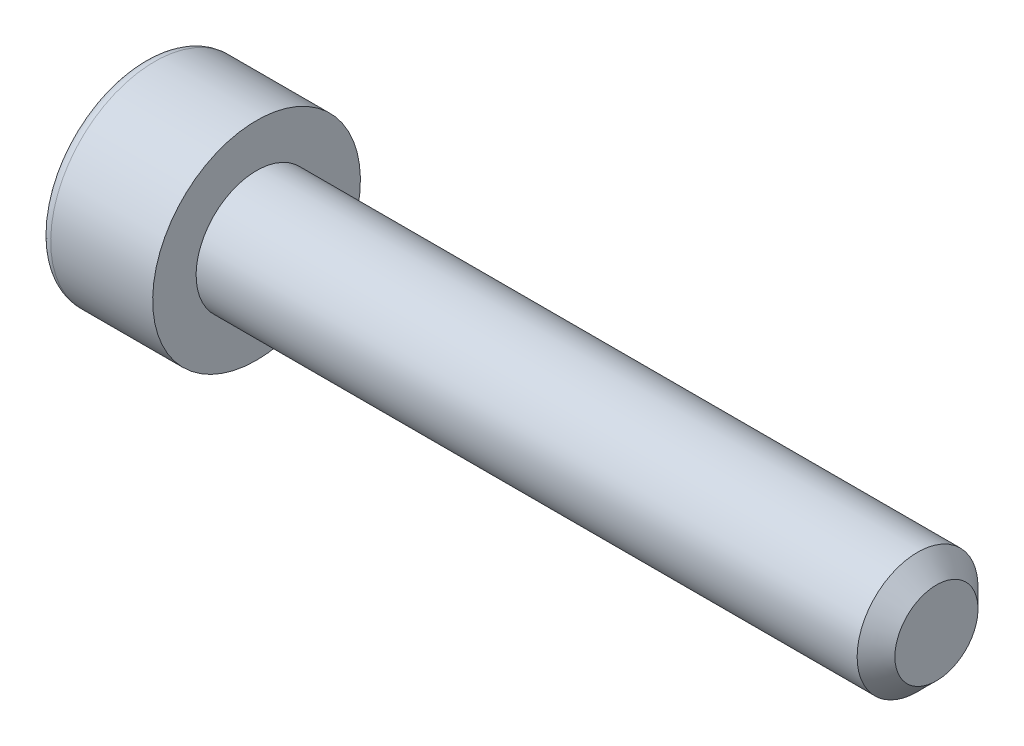
ISO-10303-21;
HEADER;
FILE_DESCRIPTION(('STEP AP214'),'2;1');
FILE_NAME('part.step','',(''),(''),'','','');
FILE_SCHEMA(('AUTOMOTIVE_DESIGN { 1 0 10303 214 1 1 1 1 }'));
ENDSEC;
DATA;
#1=APPLICATION_CONTEXT('core data for automotive mechanical design processes');
#2=APPLICATION_PROTOCOL_DEFINITION('international standard','automotive_design',2000,#1);
#3=PRODUCT_CONTEXT('',#1,'mechanical');
#4=PRODUCT('Part','Part','',(#3));
#5=PRODUCT_RELATED_PRODUCT_CATEGORY('part','',(#4));
#6=PRODUCT_DEFINITION_FORMATION('','',#4);
#7=PRODUCT_DEFINITION_CONTEXT('part definition',#1,'design');
#8=PRODUCT_DEFINITION('design','',#6,#7);
#9=PRODUCT_DEFINITION_SHAPE('','',#8);
#10=(LENGTH_UNIT() NAMED_UNIT(*) SI_UNIT(.MILLI.,.METRE.));
#11=(NAMED_UNIT(*) PLANE_ANGLE_UNIT() SI_UNIT($,.RADIAN.));
#12=(NAMED_UNIT(*) SI_UNIT($,.STERADIAN.) SOLID_ANGLE_UNIT());
#13=UNCERTAINTY_MEASURE_WITH_UNIT(LENGTH_MEASURE(1.E-05),#10,'distance_accuracy_value','');
#14=(GEOMETRIC_REPRESENTATION_CONTEXT(3) GLOBAL_UNCERTAINTY_ASSIGNED_CONTEXT((#13)) GLOBAL_UNIT_ASSIGNED_CONTEXT((#10,
#11,#12)) REPRESENTATION_CONTEXT('',''));
#15=CARTESIAN_POINT('',(0.,0.,0.));
#16=DIRECTION('',(0.,0.,1.));
#17=DIRECTION('',(1.,0.,0.));
#18=AXIS2_PLACEMENT_3D('',#15,#16,#17);
#19=CARTESIAN_POINT('',(-1.70000000002801,0.,0.));
#20=DIRECTION('',(-1.,0.,0.));
#21=DIRECTION('',(0.,0.,1.));
#22=AXIS2_PLACEMENT_3D('',#19,#20,#21);
#23=CONICAL_SURFACE('',#22,1.43650000001117,1.04719755119831);
#24=CARTESIAN_POINT('',(-0.870636338333952,0.,0.));
#25=VERTEX_POINT('',#24);
#26=VERTEX_LOOP('',#25);
#27=FACE_BOUND('',#26,.T.);
#28=CARTESIAN_POINT('',(-1.69999999996238,0.,0.));
#29=DIRECTION('',(-1.,0.,0.));
#30=DIRECTION('',(0.,0.,1.));
#31=AXIS2_PLACEMENT_3D('',#28,#29,#30);
#32=CIRCLE('',#31,1.43649999989748);
#33=CARTESIAN_POINT('',(-1.69999999996238,-0.718249999948738,-1.24404549244756));
#34=VERTEX_POINT('',#33);
#35=CARTESIAN_POINT('',(-1.69999999996238,-1.43649999989748,0.));
#36=VERTEX_POINT('',#35);
#37=EDGE_CURVE('E126',#34,#36,#32,.T.);
#38=ORIENTED_EDGE('',*,*,#37,.T.);
#39=CARTESIAN_POINT('',(-1.70000000002801,0.,0.));
#40=DIRECTION('',(-1.,0.,0.));
#41=DIRECTION('',(0.,0.,1.));
#42=AXIS2_PLACEMENT_3D('',#39,#40,#41);
#43=CIRCLE('',#42,1.43650000001117);
#44=CARTESIAN_POINT('',(-1.70000000002801,-0.718250000005583,1.24404549254602));
#45=VERTEX_POINT('',#44);
#46=EDGE_CURVE('E76',#36,#45,#43,.T.);
#47=ORIENTED_EDGE('',*,*,#46,.T.);
#48=CARTESIAN_POINT('',(-1.70000000002801,0.,0.));
#49=DIRECTION('',(-1.,0.,0.));
#50=DIRECTION('',(0.,0.,1.));
#51=AXIS2_PLACEMENT_3D('',#48,#49,#50);
#52=CIRCLE('',#51,1.43650000001117);
#53=CARTESIAN_POINT('',(-1.70000000002801,0.718250000005582,1.24404549254602));
#54=VERTEX_POINT('',#53);
#55=EDGE_CURVE('E134',#45,#54,#52,.T.);
#56=ORIENTED_EDGE('',*,*,#55,.T.);
#57=CARTESIAN_POINT('',(-1.70000000002801,0.,0.));
#58=DIRECTION('',(-1.,0.,0.));
#59=DIRECTION('',(0.,0.,1.));
#60=AXIS2_PLACEMENT_3D('',#57,#58,#59);
#61=CIRCLE('',#60,1.43650000001116);
#62=CARTESIAN_POINT('',(-1.70000000001401,1.43650000000558,9.66880570697553E-12));
#63=VERTEX_POINT('',#62);
#64=EDGE_CURVE('E132',#54,#63,#61,.T.);
#65=ORIENTED_EDGE('',*,*,#64,.T.);
#66=CARTESIAN_POINT('',(-1.70000000002801,0.,0.));
#67=DIRECTION('',(-1.,0.,0.));
#68=DIRECTION('',(0.,0.,1.));
#69=AXIS2_PLACEMENT_3D('',#66,#67,#68);
#70=CIRCLE('',#69,1.43650000001117);
#71=CARTESIAN_POINT('',(-1.70000000002801,0.718250000005581,-1.24404549254602));
#72=VERTEX_POINT('',#71);
#73=EDGE_CURVE('E130',#63,#72,#70,.T.);
#74=ORIENTED_EDGE('',*,*,#73,.T.);
#75=CARTESIAN_POINT('',(-1.70000000002801,0.,0.));
#76=DIRECTION('',(-1.,0.,0.));
#77=DIRECTION('',(0.,0.,1.));
#78=AXIS2_PLACEMENT_3D('',#75,#76,#77);
#79=CIRCLE('',#78,1.43650000001117);
#80=EDGE_CURVE('E128',#72,#34,#79,.T.);
#81=ORIENTED_EDGE('',*,*,#80,.T.);
#82=EDGE_LOOP('',(#38,#47,#56,#65,#74,#81));
#83=FACE_BOUND('',#82,.T.);
#84=ADVANCED_FACE('F16',(#27,#83),#23,.F.);
#85=CARTESIAN_POINT('',(-1.7,0.,0.));
#86=DIRECTION('',(-1.,0.,0.));
#87=DIRECTION('',(0.,-1.,0.));
#88=AXIS2_PLACEMENT_3D('',#85,#86,#87);
#89=PLANE('',#88);
#90=ORIENTED_EDGE('',*,*,#55,.F.);
#91=DIRECTION('',(0.,1.,0.));
#92=VECTOR('',#91,1.);
#93=CARTESIAN_POINT('',(-1.7,-0.71825,1.24404549253635));
#94=LINE('',#93,#92);
#95=EDGE_CURVE('E90',#45,#54,#94,.T.);
#96=ORIENTED_EDGE('',*,*,#95,.T.);
#97=EDGE_LOOP('',(#90,#96));
#98=FACE_BOUND('',#97,.T.);
#99=ADVANCED_FACE('F199',(#98),#89,.F.);
#100=CARTESIAN_POINT('',(-1.7,0.,0.));
#101=DIRECTION('',(-1.,0.,0.));
#102=DIRECTION('',(0.,-1.,0.));
#103=AXIS2_PLACEMENT_3D('',#100,#101,#102);
#104=PLANE('',#103);
#105=ORIENTED_EDGE('',*,*,#64,.F.);
#106=DIRECTION('',(0.,-0.5,0.866025403784439));
#107=VECTOR('',#106,1.);
#108=CARTESIAN_POINT('',(-1.7,0.71825,1.24404549253635));
#109=LINE('',#108,#107);
#110=EDGE_CURVE('E449',#54,#63,#109,.F.);
#111=ORIENTED_EDGE('',*,*,#110,.T.);
#112=EDGE_LOOP('',(#105,#111));
#113=FACE_BOUND('',#112,.T.);
#114=ADVANCED_FACE('F196',(#113),#104,.F.);
#115=CARTESIAN_POINT('',(-1.7,0.,0.));
#116=DIRECTION('',(-1.,0.,0.));
#117=DIRECTION('',(0.,-1.,0.));
#118=AXIS2_PLACEMENT_3D('',#115,#116,#117);
#119=PLANE('',#118);
#120=ORIENTED_EDGE('',*,*,#73,.F.);
#121=DIRECTION('',(0.,0.5,0.866025403784439));
#122=VECTOR('',#121,1.);
#123=CARTESIAN_POINT('',(-1.7,1.4365,0.));
#124=LINE('',#123,#122);
#125=EDGE_CURVE('E438',#63,#72,#124,.F.);
#126=ORIENTED_EDGE('',*,*,#125,.T.);
#127=EDGE_LOOP('',(#120,#126));
#128=FACE_BOUND('',#127,.T.);
#129=ADVANCED_FACE('F192',(#128),#119,.F.);
#130=CARTESIAN_POINT('',(-1.7,0.,0.));
#131=DIRECTION('',(-1.,0.,0.));
#132=DIRECTION('',(0.,-1.,0.));
#133=AXIS2_PLACEMENT_3D('',#130,#131,#132);
#134=PLANE('',#133);
#135=ORIENTED_EDGE('',*,*,#80,.F.);
#136=DIRECTION('',(0.,1.,0.));
#137=VECTOR('',#136,1.);
#138=CARTESIAN_POINT('',(-1.7,0.71825,-1.24404549253635));
#139=LINE('',#138,#137);
#140=EDGE_CURVE('E427',#72,#34,#139,.F.);
#141=ORIENTED_EDGE('',*,*,#140,.T.);
#142=EDGE_LOOP('',(#135,#141));
#143=FACE_BOUND('',#142,.T.);
#144=ADVANCED_FACE('F188',(#143),#134,.F.);
#145=CARTESIAN_POINT('',(-1.7,0.,0.));
#146=DIRECTION('',(-1.,0.,0.));
#147=DIRECTION('',(0.,-1.,0.));
#148=AXIS2_PLACEMENT_3D('',#145,#146,#147);
#149=PLANE('',#148);
#150=ORIENTED_EDGE('',*,*,#37,.F.);
#151=DIRECTION('',(0.,0.499999999999999,-0.866025403784439));
#152=VECTOR('',#151,1.);
#153=CARTESIAN_POINT('',(-1.7,-0.71825,-1.24404549253635));
#154=LINE('',#153,#152);
#155=EDGE_CURVE('E409',#34,#36,#154,.F.);
#156=ORIENTED_EDGE('',*,*,#155,.T.);
#157=EDGE_LOOP('',(#150,#156));
#158=FACE_BOUND('',#157,.T.);
#159=ADVANCED_FACE('F184',(#158),#149,.F.);
#160=CARTESIAN_POINT('',(-1.7,0.,0.));
#161=DIRECTION('',(-1.,0.,0.));
#162=DIRECTION('',(0.,-1.,0.));
#163=AXIS2_PLACEMENT_3D('',#160,#161,#162);
#164=PLANE('',#163);
#165=ORIENTED_EDGE('',*,*,#46,.F.);
#166=DIRECTION('',(0.,-0.5,-0.866025403784439));
#167=VECTOR('',#166,1.);
#168=CARTESIAN_POINT('',(-1.7,-1.4365,0.));
#169=LINE('',#168,#167);
#170=EDGE_CURVE('E93',#36,#45,#169,.F.);
#171=ORIENTED_EDGE('',*,*,#170,.T.);
#172=EDGE_LOOP('',(#165,#171));
#173=FACE_BOUND('',#172,.T.);
#174=ADVANCED_FACE('F181',(#173),#164,.F.);
#175=CARTESIAN_POINT('',(-1.7,-0.71825,1.24404549253635));
#176=DIRECTION('',(0.,0.,1.));
#177=DIRECTION('',(1.,0.,0.));
#178=AXIS2_PLACEMENT_3D('',#175,#176,#177);
#179=PLANE('',#178);
#180=DIRECTION('',(1.,0.,0.));
#181=VECTOR('',#180,1.);
#182=CARTESIAN_POINT('',(-1.7,0.71825,1.24404549253635));
#183=LINE('',#182,#181);
#184=CARTESIAN_POINT('',(-3.,0.71825,1.24404549253635));
#185=VERTEX_POINT('',#184);
#186=EDGE_CURVE('E414',#185,#54,#183,.T.);
#187=ORIENTED_EDGE('',*,*,#186,.T.);
#188=ORIENTED_EDGE('',*,*,#95,.F.);
#189=DIRECTION('',(1.,0.,0.));
#190=VECTOR('',#189,1.);
#191=CARTESIAN_POINT('',(-1.7,-0.718250000000002,1.24404549253635));
#192=LINE('',#191,#190);
#193=CARTESIAN_POINT('',(-3.,-0.718250000000001,1.24404549253635));
#194=VERTEX_POINT('',#193);
#195=EDGE_CURVE('E82',#45,#194,#192,.F.);
#196=ORIENTED_EDGE('',*,*,#195,.T.);
#197=DIRECTION('',(0.,1.,0.));
#198=VECTOR('',#197,1.);
#199=CARTESIAN_POINT('',(-3.,1.4365,1.24404549253635));
#200=LINE('',#199,#198);
#201=EDGE_CURVE('E87',#194,#185,#200,.T.);
#202=ORIENTED_EDGE('',*,*,#201,.T.);
#203=EDGE_LOOP('',(#187,#188,#196,#202));
#204=FACE_BOUND('',#203,.T.);
#205=ADVANCED_FACE('F85',(#204),#179,.F.);
#206=CARTESIAN_POINT('',(-1.7,0.71825,1.24404549253635));
#207=DIRECTION('',(0.,0.866025403784439,0.5));
#208=DIRECTION('',(0.,-0.5,0.866025403784439));
#209=AXIS2_PLACEMENT_3D('',#206,#207,#208);
#210=PLANE('',#209);
#211=DIRECTION('',(1.,0.,0.));
#212=VECTOR('',#211,1.);
#213=CARTESIAN_POINT('',(-1.7,1.4365,0.));
#214=LINE('',#213,#212);
#215=CARTESIAN_POINT('',(-3.,1.4365,0.));
#216=VERTEX_POINT('',#215);
#217=EDGE_CURVE('E443',#216,#63,#214,.T.);
#218=ORIENTED_EDGE('',*,*,#217,.T.);
#219=ORIENTED_EDGE('',*,*,#110,.F.);
#220=ORIENTED_EDGE('',*,*,#186,.F.);
#221=DIRECTION('',(0.,0.499999999999999,-0.866025403784439));
#222=VECTOR('',#221,1.);
#223=CARTESIAN_POINT('',(-3.,0.71825,1.24404549253635));
#224=LINE('',#223,#222);
#225=EDGE_CURVE('E108',#185,#216,#224,.T.);
#226=ORIENTED_EDGE('',*,*,#225,.T.);
#227=EDGE_LOOP('',(#218,#219,#220,#226));
#228=FACE_BOUND('',#227,.T.);
#229=ADVANCED_FACE('F174',(#228),#210,.F.);
#230=CARTESIAN_POINT('',(-1.7,1.4365,0.));
#231=DIRECTION('',(0.,0.866025403784439,-0.5));
#232=DIRECTION('',(0.,0.5,0.866025403784439));
#233=AXIS2_PLACEMENT_3D('',#230,#231,#232);
#234=PLANE('',#233);
#235=DIRECTION('',(-1.,0.,0.));
#236=VECTOR('',#235,1.);
#237=CARTESIAN_POINT('',(-1.7,0.71825,-1.24404549253635));
#238=LINE('',#237,#236);
#239=CARTESIAN_POINT('',(-3.,0.71825,-1.24404549253635));
#240=VERTEX_POINT('',#239);
#241=EDGE_CURVE('E432',#240,#72,#238,.F.);
#242=ORIENTED_EDGE('',*,*,#241,.T.);
#243=ORIENTED_EDGE('',*,*,#125,.F.);
#244=ORIENTED_EDGE('',*,*,#217,.F.);
#245=DIRECTION('',(0.,-0.500000000000001,-0.866025403784438));
#246=VECTOR('',#245,1.);
#247=CARTESIAN_POINT('',(-3.,1.4365,0.));
#248=LINE('',#247,#246);
#249=EDGE_CURVE('E110',#216,#240,#248,.T.);
#250=ORIENTED_EDGE('',*,*,#249,.T.);
#251=EDGE_LOOP('',(#242,#243,#244,#250));
#252=FACE_BOUND('',#251,.T.);
#253=ADVANCED_FACE('F170',(#252),#234,.F.);
#254=CARTESIAN_POINT('',(-1.7,0.71825,-1.24404549253635));
#255=DIRECTION('',(0.,0.,-1.));
#256=DIRECTION('',(-1.,0.,0.));
#257=AXIS2_PLACEMENT_3D('',#254,#255,#256);
#258=PLANE('',#257);
#259=DIRECTION('',(1.,0.,0.));
#260=VECTOR('',#259,1.);
#261=CARTESIAN_POINT('',(-1.7,-0.71825,-1.24404549253635));
#262=LINE('',#261,#260);
#263=CARTESIAN_POINT('',(-3.,-0.71825,-1.24404549253635));
#264=VERTEX_POINT('',#263);
#265=EDGE_CURVE('E418',#264,#34,#262,.T.);
#266=ORIENTED_EDGE('',*,*,#265,.T.);
#267=ORIENTED_EDGE('',*,*,#140,.F.);
#268=ORIENTED_EDGE('',*,*,#241,.F.);
#269=DIRECTION('',(0.,1.,0.));
#270=VECTOR('',#269,1.);
#271=CARTESIAN_POINT('',(-3.,1.4365,-1.24404549253634));
#272=LINE('',#271,#270);
#273=EDGE_CURVE('E420',#240,#264,#272,.F.);
#274=ORIENTED_EDGE('',*,*,#273,.T.);
#275=EDGE_LOOP('',(#266,#267,#268,#274));
#276=FACE_BOUND('',#275,.T.);
#277=ADVANCED_FACE('F166',(#276),#258,.F.);
#278=CARTESIAN_POINT('',(-1.7,-0.71825,-1.24404549253635));
#279=DIRECTION('',(0.,-0.866025403784439,-0.499999999999999));
#280=DIRECTION('',(0.,0.499999999999999,-0.866025403784439));
#281=AXIS2_PLACEMENT_3D('',#278,#279,#280);
#282=PLANE('',#281);
#283=DIRECTION('',(1.,0.,0.));
#284=VECTOR('',#283,1.);
#285=CARTESIAN_POINT('',(-1.7,-1.4365,0.));
#286=LINE('',#285,#284);
#287=CARTESIAN_POINT('',(-3.,-1.4365,0.));
#288=VERTEX_POINT('',#287);
#289=EDGE_CURVE('E100',#288,#36,#286,.T.);
#290=ORIENTED_EDGE('',*,*,#289,.T.);
#291=ORIENTED_EDGE('',*,*,#155,.F.);
#292=ORIENTED_EDGE('',*,*,#265,.F.);
#293=DIRECTION('',(0.,-0.499999999999999,0.866025403784439));
#294=VECTOR('',#293,1.);
#295=CARTESIAN_POINT('',(-3.,-0.71825,-1.24404549253635));
#296=LINE('',#295,#294);
#297=EDGE_CURVE('E103',#264,#288,#296,.T.);
#298=ORIENTED_EDGE('',*,*,#297,.T.);
#299=EDGE_LOOP('',(#290,#291,#292,#298));
#300=FACE_BOUND('',#299,.T.);
#301=ADVANCED_FACE('F163',(#300),#282,.F.);
#302=CARTESIAN_POINT('',(-1.7,-1.4365,0.));
#303=DIRECTION('',(0.,-0.866025403784439,0.5));
#304=DIRECTION('',(0.,-0.5,-0.866025403784439));
#305=AXIS2_PLACEMENT_3D('',#302,#303,#304);
#306=PLANE('',#305);
#307=ORIENTED_EDGE('',*,*,#195,.F.);
#308=ORIENTED_EDGE('',*,*,#170,.F.);
#309=ORIENTED_EDGE('',*,*,#289,.F.);
#310=DIRECTION('',(0.,0.499999999999999,0.866025403784439));
#311=VECTOR('',#310,1.);
#312=CARTESIAN_POINT('',(-3.,-1.4365,0.));
#313=LINE('',#312,#311);
#314=EDGE_CURVE('E97',#288,#194,#313,.T.);
#315=ORIENTED_EDGE('',*,*,#314,.T.);
#316=EDGE_LOOP('',(#307,#308,#309,#315));
#317=FACE_BOUND('',#316,.T.);
#318=ADVANCED_FACE('F98',(#317),#306,.F.);
#319=CARTESIAN_POINT('',(-3.,1.4365,0.));
#320=DIRECTION('',(1.,0.,0.));
#321=DIRECTION('',(0.,1.,0.));
#322=AXIS2_PLACEMENT_3D('',#319,#320,#321);
#323=PLANE('',#322);
#324=CARTESIAN_POINT('',(-3.,0.,0.));
#325=DIRECTION('',(1.,0.,0.));
#326=DIRECTION('',(0.,-1.,0.));
#327=AXIS2_PLACEMENT_3D('',#324,#325,#326);
#328=CIRCLE('',#327,2.45);
#329=CARTESIAN_POINT('',(-3.,-2.45,0.));
#330=VERTEX_POINT('',#329);
#331=CARTESIAN_POINT('',(-3.,2.45,0.));
#332=VERTEX_POINT('',#331);
#333=EDGE_CURVE('E35',#330,#332,#328,.T.);
#334=ORIENTED_EDGE('',*,*,#333,.F.);
#335=CARTESIAN_POINT('',(-3.,0.,0.));
#336=DIRECTION('',(1.,0.,0.));
#337=DIRECTION('',(0.,1.,0.));
#338=AXIS2_PLACEMENT_3D('',#335,#336,#337);
#339=CIRCLE('',#338,2.45);
#340=EDGE_CURVE('E138',#332,#330,#339,.T.);
#341=ORIENTED_EDGE('',*,*,#340,.F.);
#342=EDGE_LOOP('',(#334,#341));
#343=FACE_BOUND('',#342,.T.);
#344=ORIENTED_EDGE('',*,*,#297,.F.);
#345=ORIENTED_EDGE('',*,*,#273,.F.);
#346=ORIENTED_EDGE('',*,*,#249,.F.);
#347=ORIENTED_EDGE('',*,*,#225,.F.);
#348=ORIENTED_EDGE('',*,*,#201,.F.);
#349=ORIENTED_EDGE('',*,*,#314,.F.);
#350=EDGE_LOOP('',(#344,#345,#346,#347,#348,#349));
#351=FACE_BOUND('',#350,.T.);
#352=ADVANCED_FACE('F106',(#343,#351),#323,.F.);
#353=CARTESIAN_POINT('',(-2.7,0.,0.));
#354=DIRECTION('',(-1.,0.,0.));
#355=DIRECTION('',(0.,1.,0.));
#356=AXIS2_PLACEMENT_3D('',#353,#354,#355);
#357=TOROIDAL_SURFACE('',#356,2.45,0.3);
#358=ORIENTED_EDGE('',*,*,#333,.T.);
#359=ORIENTED_EDGE('',*,*,#340,.T.);
#360=EDGE_LOOP('',(#358,#359));
#361=FACE_BOUND('',#360,.T.);
#362=CARTESIAN_POINT('',(-2.7,0.,0.));
#363=DIRECTION('',(-1.,0.,0.));
#364=DIRECTION('',(0.,-1.,0.));
#365=AXIS2_PLACEMENT_3D('',#362,#363,#364);
#366=CIRCLE('',#365,2.75);
#367=CARTESIAN_POINT('',(-2.7,-2.75,0.));
#368=VERTEX_POINT('',#367);
#369=EDGE_CURVE('E124',#368,#368,#366,.F.);
#370=ORIENTED_EDGE('',*,*,#369,.F.);
#371=EDGE_LOOP('',(#370));
#372=FACE_BOUND('',#371,.T.);
#373=ADVANCED_FACE('F136',(#361,#372),#357,.T.);
#374=CARTESIAN_POINT('',(18.,0.,0.));
#375=DIRECTION('',(1.,0.,0.));
#376=DIRECTION('',(0.,0.,-1.));
#377=AXIS2_PLACEMENT_3D('',#374,#375,#376);
#378=PLANE('',#377);
#379=CARTESIAN_POINT('',(17.9999999999723,0.,0.));
#380=DIRECTION('',(-1.,0.,0.));
#381=DIRECTION('',(0.,0.,1.));
#382=AXIS2_PLACEMENT_3D('',#379,#380,#381);
#383=CIRCLE('',#382,1.1000000000081);
#384=CARTESIAN_POINT('',(17.9999999999723,0.,1.1000000000081));
#385=VERTEX_POINT('',#384);
#386=EDGE_CURVE('E121',#385,#385,#383,.T.);
#387=ORIENTED_EDGE('',*,*,#386,.F.);
#388=EDGE_LOOP('',(#387));
#389=FACE_BOUND('',#388,.T.);
#390=ADVANCED_FACE('F226',(#389),#378,.T.);
#391=CARTESIAN_POINT('',(-0.870636338309101,0.,0.));
#392=DIRECTION('',(-1.,0.,0.));
#393=DIRECTION('',(0.,-1.,0.));
#394=AXIS2_PLACEMENT_3D('',#391,#392,#393);
#395=CYLINDRICAL_SURFACE('',#394,2.75);
#396=ORIENTED_EDGE('',*,*,#369,.T.);
#397=EDGE_LOOP('',(#396));
#398=FACE_BOUND('',#397,.T.);
#399=CARTESIAN_POINT('',(0.,0.,0.));
#400=DIRECTION('',(-1.,0.,0.));
#401=DIRECTION('',(0.,-1.,0.));
#402=AXIS2_PLACEMENT_3D('',#399,#400,#401);
#403=CIRCLE('',#402,2.75);
#404=CARTESIAN_POINT('',(0.,-2.75,0.));
#405=VERTEX_POINT('',#404);
#406=EDGE_CURVE('E118',#405,#405,#403,.T.);
#407=ORIENTED_EDGE('',*,*,#406,.T.);
#408=EDGE_LOOP('',(#407));
#409=FACE_BOUND('',#408,.T.);
#410=ADVANCED_FACE('F223',(#398,#409),#395,.T.);
#411=CARTESIAN_POINT('',(17.4999999999841,0.,0.));
#412=DIRECTION('',(-1.,0.,0.));
#413=DIRECTION('',(0.,0.,1.));
#414=AXIS2_PLACEMENT_3D('',#411,#412,#413);
#415=CONICAL_SURFACE('',#414,1.59999999999627,0.785398163397448);
#416=CARTESIAN_POINT('',(17.5,0.,0.));
#417=DIRECTION('',(-1.,0.,0.));
#418=DIRECTION('',(0.,-1.,0.));
#419=AXIS2_PLACEMENT_3D('',#416,#417,#418);
#420=CIRCLE('',#419,1.6);
#421=CARTESIAN_POINT('',(17.5,-1.6,0.));
#422=VERTEX_POINT('',#421);
#423=EDGE_CURVE('E27',#422,#422,#420,.T.);
#424=ORIENTED_EDGE('',*,*,#423,.F.);
#425=EDGE_LOOP('',(#424));
#426=FACE_BOUND('',#425,.T.);
#427=ORIENTED_EDGE('',*,*,#386,.T.);
#428=EDGE_LOOP('',(#427));
#429=FACE_BOUND('',#428,.T.);
#430=ADVANCED_FACE('F216',(#426,#429),#415,.T.);
#431=CARTESIAN_POINT('',(0.,2.75,0.));
#432=DIRECTION('',(-1.,0.,0.));
#433=DIRECTION('',(0.,-1.,0.));
#434=AXIS2_PLACEMENT_3D('',#431,#432,#433);
#435=PLANE('',#434);
#436=CARTESIAN_POINT('',(0.,0.,0.));
#437=DIRECTION('',(-1.,0.,0.));
#438=DIRECTION('',(0.,-1.,0.));
#439=AXIS2_PLACEMENT_3D('',#436,#437,#438);
#440=CIRCLE('',#439,1.6);
#441=CARTESIAN_POINT('',(0.,-1.6,0.));
#442=VERTEX_POINT('',#441);
#443=EDGE_CURVE('E11',#442,#442,#440,.F.);
#444=ORIENTED_EDGE('',*,*,#443,.F.);
#445=EDGE_LOOP('',(#444));
#446=FACE_BOUND('',#445,.T.);
#447=ORIENTED_EDGE('',*,*,#406,.F.);
#448=EDGE_LOOP('',(#447));
#449=FACE_BOUND('',#448,.T.);
#450=ADVANCED_FACE('F210',(#446,#449),#435,.F.);
#451=CARTESIAN_POINT('',(16.,0.,0.));
#452=DIRECTION('',(-1.,0.,0.));
#453=DIRECTION('',(0.,-1.,0.));
#454=AXIS2_PLACEMENT_3D('',#451,#452,#453);
#455=CYLINDRICAL_SURFACE('',#454,1.6);
#456=ORIENTED_EDGE('',*,*,#443,.T.);
#457=EDGE_LOOP('',(#456));
#458=FACE_BOUND('',#457,.T.);
#459=ORIENTED_EDGE('',*,*,#423,.T.);
#460=EDGE_LOOP('',(#459));
#461=FACE_BOUND('',#460,.T.);
#462=ADVANCED_FACE('F208',(#458,#461),#455,.T.);
#463=CLOSED_SHELL('',(#84,#99,#114,#129,#144,#159,#174,#205,#229,#253,#277,#301,#318,#352,#373,
#390,#410,#430,#450,#462));
#464=MANIFOLD_SOLID_BREP('B1',#463);
#465=ADVANCED_BREP_SHAPE_REPRESENTATION('',(#18,#464),#14);
#466=SHAPE_DEFINITION_REPRESENTATION(#9,#465);
ENDSEC;
END-ISO-10303-21;
